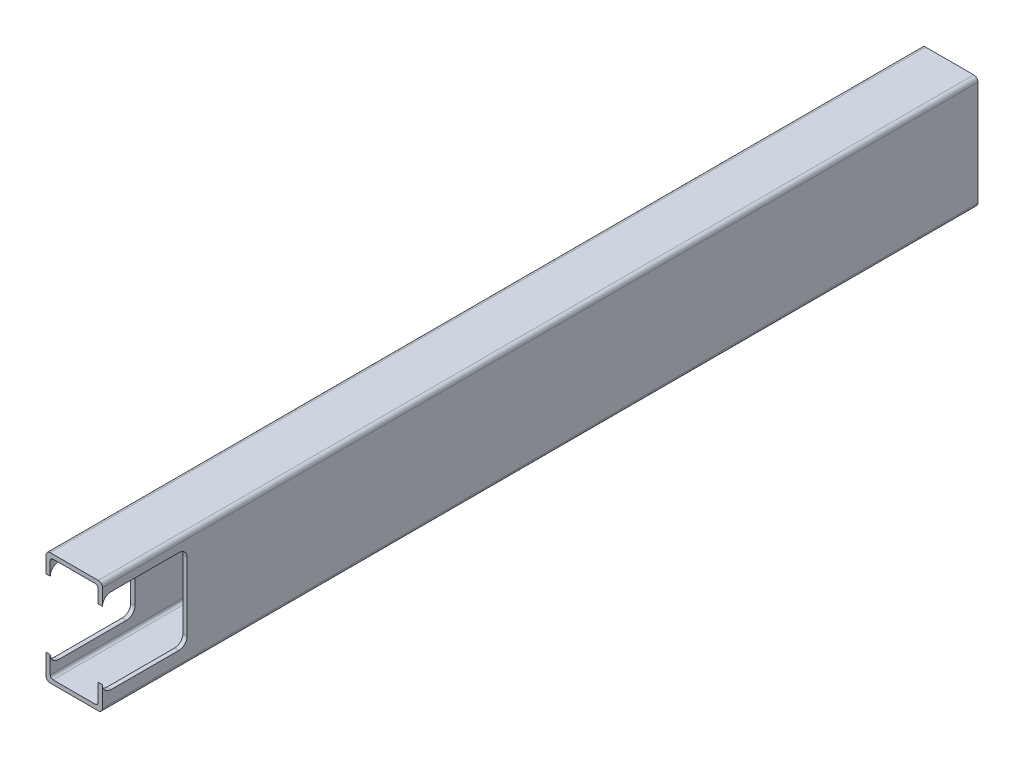
ISO-10303-21;
HEADER;
FILE_DESCRIPTION(('STEP AP214'),'2;1');
FILE_NAME('part.step','',(''),(''),'','','');
FILE_SCHEMA(('AUTOMOTIVE_DESIGN { 1 0 10303 214 1 1 1 1 }'));
ENDSEC;
DATA;
#1=APPLICATION_CONTEXT('core data for automotive mechanical design processes');
#2=APPLICATION_PROTOCOL_DEFINITION('international standard','automotive_design',2000,#1);
#3=PRODUCT_CONTEXT('',#1,'mechanical');
#4=PRODUCT('Part','Part','',(#3));
#5=PRODUCT_RELATED_PRODUCT_CATEGORY('part','',(#4));
#6=PRODUCT_DEFINITION_FORMATION('','',#4);
#7=PRODUCT_DEFINITION_CONTEXT('part definition',#1,'design');
#8=PRODUCT_DEFINITION('design','',#6,#7);
#9=PRODUCT_DEFINITION_SHAPE('','',#8);
#10=(LENGTH_UNIT() NAMED_UNIT(*) SI_UNIT(.MILLI.,.METRE.));
#11=(NAMED_UNIT(*) PLANE_ANGLE_UNIT() SI_UNIT($,.RADIAN.));
#12=(NAMED_UNIT(*) SI_UNIT($,.STERADIAN.) SOLID_ANGLE_UNIT());
#13=UNCERTAINTY_MEASURE_WITH_UNIT(LENGTH_MEASURE(1.E-05),#10,'distance_accuracy_value','');
#14=(GEOMETRIC_REPRESENTATION_CONTEXT(3) GLOBAL_UNCERTAINTY_ASSIGNED_CONTEXT((#13)) GLOBAL_UNIT_ASSIGNED_CONTEXT((#10,
#11,#12)) REPRESENTATION_CONTEXT('',''));
#15=CARTESIAN_POINT('',(0.,0.,0.));
#16=DIRECTION('',(0.,0.,1.));
#17=DIRECTION('',(1.,0.,0.));
#18=AXIS2_PLACEMENT_3D('',#15,#16,#17);
#19=CARTESIAN_POINT('',(-1.5,38.5,30.));
#20=DIRECTION('',(0.,0.,-1.));
#21=DIRECTION('',(-1.,0.,0.));
#22=AXIS2_PLACEMENT_3D('',#19,#20,#21);
#23=PLANE('',#22);
#24=DIRECTION('',(1.,0.,0.));
#25=VECTOR('',#24,1.);
#26=CARTESIAN_POINT('',(-69.4264068711928,32.7499999983111,30.));
#27=LINE('',#26,#25);
#28=CARTESIAN_POINT('',(0.,32.7499999983111,30.));
#29=VERTEX_POINT('',#28);
#30=CARTESIAN_POINT('',(-1.5,32.7499999983111,30.));
#31=VERTEX_POINT('',#30);
#32=EDGE_CURVE('E346',#29,#31,#27,.F.);
#33=ORIENTED_EDGE('',*,*,#32,.F.);
#34=DIRECTION('',(0.,1.,0.));
#35=VECTOR('',#34,1.);
#36=CARTESIAN_POINT('',(0.,38.5,30.));
#37=LINE('',#36,#35);
#38=CARTESIAN_POINT('',(0.,38.5,30.));
#39=VERTEX_POINT('',#38);
#40=EDGE_CURVE('E426',#29,#39,#37,.T.);
#41=ORIENTED_EDGE('',*,*,#40,.T.);
#42=CARTESIAN_POINT('',(-1.5,38.5,30.));
#43=DIRECTION('',(0.,0.,1.));
#44=DIRECTION('',(-1.,0.,0.));
#45=AXIS2_PLACEMENT_3D('',#42,#43,#44);
#46=CIRCLE('',#45,1.5);
#47=CARTESIAN_POINT('',(-1.50000000000002,40.,30.));
#48=VERTEX_POINT('',#47);
#49=EDGE_CURVE('E423',#39,#48,#46,.T.);
#50=ORIENTED_EDGE('',*,*,#49,.T.);
#51=DIRECTION('',(-1.,0.,0.));
#52=VECTOR('',#51,1.);
#53=CARTESIAN_POINT('',(-18.5,40.,30.));
#54=LINE('',#53,#52);
#55=CARTESIAN_POINT('',(-18.5,40.,30.));
#56=VERTEX_POINT('',#55);
#57=EDGE_CURVE('E420',#48,#56,#54,.T.);
#58=ORIENTED_EDGE('',*,*,#57,.T.);
#59=CARTESIAN_POINT('',(-18.5,38.5,30.));
#60=DIRECTION('',(0.,0.,1.));
#61=DIRECTION('',(-1.,0.,0.));
#62=AXIS2_PLACEMENT_3D('',#59,#60,#61);
#63=CIRCLE('',#62,1.50000000000001);
#64=CARTESIAN_POINT('',(-20.,38.5,30.));
#65=VERTEX_POINT('',#64);
#66=EDGE_CURVE('E417',#56,#65,#63,.T.);
#67=ORIENTED_EDGE('',*,*,#66,.T.);
#68=DIRECTION('',(0.,-1.,0.));
#69=VECTOR('',#68,1.);
#70=CARTESIAN_POINT('',(-20.,38.5,30.));
#71=LINE('',#70,#69);
#72=CARTESIAN_POINT('',(-20.,32.7499999983111,30.));
#73=VERTEX_POINT('',#72);
#74=EDGE_CURVE('E413',#65,#73,#71,.T.);
#75=ORIENTED_EDGE('',*,*,#74,.T.);
#76=CARTESIAN_POINT('',(-18.5,32.7499999983111,30.));
#77=VERTEX_POINT('',#76);
#78=EDGE_CURVE('E342',#77,#73,#27,.F.);
#79=ORIENTED_EDGE('',*,*,#78,.F.);
#80=DIRECTION('',(0.,-1.,0.));
#81=VECTOR('',#80,1.);
#82=CARTESIAN_POINT('',(-18.5,37.5,30.));
#83=LINE('',#82,#81);
#84=CARTESIAN_POINT('',(-18.5,37.5,30.));
#85=VERTEX_POINT('',#84);
#86=EDGE_CURVE('E435',#85,#77,#83,.T.);
#87=ORIENTED_EDGE('',*,*,#86,.F.);
#88=CARTESIAN_POINT('',(-17.5,37.5,30.));
#89=DIRECTION('',(0.,0.,1.));
#90=DIRECTION('',(-1.,0.,0.));
#91=AXIS2_PLACEMENT_3D('',#88,#89,#90);
#92=CIRCLE('',#91,1.);
#93=CARTESIAN_POINT('',(-17.5,38.5,30.));
#94=VERTEX_POINT('',#93);
#95=EDGE_CURVE('E438',#94,#85,#92,.T.);
#96=ORIENTED_EDGE('',*,*,#95,.F.);
#97=DIRECTION('',(-1.,0.,0.));
#98=VECTOR('',#97,1.);
#99=CARTESIAN_POINT('',(-17.5,38.5,30.));
#100=LINE('',#99,#98);
#101=CARTESIAN_POINT('',(-2.5,38.5,30.));
#102=VERTEX_POINT('',#101);
#103=EDGE_CURVE('E271',#102,#94,#100,.T.);
#104=ORIENTED_EDGE('',*,*,#103,.F.);
#105=CARTESIAN_POINT('',(-2.5,37.5,30.));
#106=DIRECTION('',(0.,0.,1.));
#107=DIRECTION('',(-1.,0.,0.));
#108=AXIS2_PLACEMENT_3D('',#105,#106,#107);
#109=CIRCLE('',#108,1.);
#110=CARTESIAN_POINT('',(-1.5,37.5,30.));
#111=VERTEX_POINT('',#110);
#112=EDGE_CURVE('E260',#111,#102,#109,.T.);
#113=ORIENTED_EDGE('',*,*,#112,.F.);
#114=DIRECTION('',(0.,1.,0.));
#115=VECTOR('',#114,1.);
#116=CARTESIAN_POINT('',(-1.5,37.5,30.));
#117=LINE('',#116,#115);
#118=EDGE_CURVE('E248',#31,#111,#117,.T.);
#119=ORIENTED_EDGE('',*,*,#118,.F.);
#120=EDGE_LOOP('',(#33,#41,#50,#58,#67,#75,#79,#87,#96,#104,#113,#119));
#121=FACE_BOUND('',#120,.T.);
#122=ADVANCED_FACE('F36',(#121),#23,.F.);
#123=CARTESIAN_POINT('',(-1.5,38.5,-394.721359549899));
#124=DIRECTION('',(0.,0.,1.));
#125=DIRECTION('',(1.,0.,0.));
#126=AXIS2_PLACEMENT_3D('',#123,#124,#125);
#127=CYLINDRICAL_SURFACE('',#126,1.5);
#128=DIRECTION('',(0.,0.,1.));
#129=VECTOR('',#128,1.);
#130=CARTESIAN_POINT('',(0.,38.5,-394.721359549899));
#131=LINE('',#130,#129);
#132=CARTESIAN_POINT('',(0.,38.5,-279.999999999903));
#133=VERTEX_POINT('',#132);
#134=EDGE_CURVE('E469',#133,#39,#131,.T.);
#135=ORIENTED_EDGE('',*,*,#134,.F.);
#136=CARTESIAN_POINT('',(-1.5,38.5,-279.999999999903));
#137=DIRECTION('',(0.,0.,-1.));
#138=DIRECTION('',(-1.,0.,0.));
#139=AXIS2_PLACEMENT_3D('',#136,#137,#138);
#140=CIRCLE('',#139,1.5);
#141=CARTESIAN_POINT('',(-1.50000000000002,40.,-279.999999999903));
#142=VERTEX_POINT('',#141);
#143=EDGE_CURVE('E416',#133,#142,#140,.F.);
#144=ORIENTED_EDGE('',*,*,#143,.T.);
#145=DIRECTION('',(0.,0.,1.));
#146=VECTOR('',#145,1.);
#147=CARTESIAN_POINT('',(-1.50000000000002,40.,-394.721359549899));
#148=LINE('',#147,#146);
#149=EDGE_CURVE('E336',#142,#48,#148,.T.);
#150=ORIENTED_EDGE('',*,*,#149,.T.);
#151=ORIENTED_EDGE('',*,*,#49,.F.);
#152=EDGE_LOOP('',(#135,#144,#150,#151));
#153=FACE_BOUND('',#152,.T.);
#154=ADVANCED_FACE('F516',(#153),#127,.T.);
#155=CARTESIAN_POINT('',(0.,38.5,-394.721359549899));
#156=DIRECTION('',(1.,0.,0.));
#157=DIRECTION('',(0.,1.,0.));
#158=AXIS2_PLACEMENT_3D('',#155,#156,#157);
#159=PLANE('',#158);
#160=ORIENTED_EDGE('',*,*,#40,.F.);
#161=CARTESIAN_POINT('',(0.,32.7499999983111,27.));
#162=DIRECTION('',(1.,0.,0.));
#163=DIRECTION('',(0.,1.,0.));
#164=AXIS2_PLACEMENT_3D('',#161,#162,#163);
#165=CIRCLE('',#164,3.);
#166=CARTESIAN_POINT('',(0.,35.7499999983111,27.));
#167=VERTEX_POINT('',#166);
#168=EDGE_CURVE('E309',#29,#167,#165,.F.);
#169=ORIENTED_EDGE('',*,*,#168,.T.);
#170=DIRECTION('',(0.,0.,-1.));
#171=VECTOR('',#170,1.);
#172=CARTESIAN_POINT('',(0.,35.7499999983111,-394.721359549899));
#173=LINE('',#172,#171);
#174=CARTESIAN_POINT('',(0.,35.7499999983111,3.00000000000003));
#175=VERTEX_POINT('',#174);
#176=EDGE_CURVE('E299',#167,#175,#173,.T.);
#177=ORIENTED_EDGE('',*,*,#176,.T.);
#178=CARTESIAN_POINT('',(0.,32.7499999983111,3.00000000000001));
#179=DIRECTION('',(1.,0.,0.));
#180=DIRECTION('',(0.,1.,0.));
#181=AXIS2_PLACEMENT_3D('',#178,#179,#180);
#182=CIRCLE('',#181,3.);
#183=CARTESIAN_POINT('',(0.,32.7499999983111,0.));
#184=VERTEX_POINT('',#183);
#185=EDGE_CURVE('E288',#175,#184,#182,.F.);
#186=ORIENTED_EDGE('',*,*,#185,.T.);
#187=DIRECTION('',(0.,-1.,0.));
#188=VECTOR('',#187,1.);
#189=CARTESIAN_POINT('',(0.,38.5,0.));
#190=LINE('',#189,#188);
#191=CARTESIAN_POINT('',(0.,8.74999999831115,0.));
#192=VERTEX_POINT('',#191);
#193=EDGE_CURVE('E53',#184,#192,#190,.T.);
#194=ORIENTED_EDGE('',*,*,#193,.T.);
#195=CARTESIAN_POINT('',(0.,8.74999999831115,3.00000000000001));
#196=DIRECTION('',(1.,0.,0.));
#197=DIRECTION('',(0.,1.,0.));
#198=AXIS2_PLACEMENT_3D('',#195,#196,#197);
#199=CIRCLE('',#198,3.);
#200=CARTESIAN_POINT('',(0.,5.74999999831114,3.00000000000001));
#201=VERTEX_POINT('',#200);
#202=EDGE_CURVE('E287',#192,#201,#199,.F.);
#203=ORIENTED_EDGE('',*,*,#202,.T.);
#204=DIRECTION('',(0.,0.,1.));
#205=VECTOR('',#204,1.);
#206=CARTESIAN_POINT('',(0.,5.74999999831111,-394.721359549899));
#207=LINE('',#206,#205);
#208=CARTESIAN_POINT('',(0.,5.74999999831115,27.));
#209=VERTEX_POINT('',#208);
#210=EDGE_CURVE('E318',#201,#209,#207,.T.);
#211=ORIENTED_EDGE('',*,*,#210,.T.);
#212=CARTESIAN_POINT('',(0.,8.74999999831114,27.));
#213=DIRECTION('',(1.,0.,0.));
#214=DIRECTION('',(0.,1.,0.));
#215=AXIS2_PLACEMENT_3D('',#212,#213,#214);
#216=CIRCLE('',#215,3.);
#217=CARTESIAN_POINT('',(0.,8.74999999831115,30.));
#218=VERTEX_POINT('',#217);
#219=EDGE_CURVE('E321',#209,#218,#216,.F.);
#220=ORIENTED_EDGE('',*,*,#219,.T.);
#221=CARTESIAN_POINT('',(0.,1.50000000000002,30.));
#222=VERTEX_POINT('',#221);
#223=EDGE_CURVE('E407',#222,#218,#37,.T.);
#224=ORIENTED_EDGE('',*,*,#223,.F.);
#225=DIRECTION('',(0.,0.,1.));
#226=VECTOR('',#225,1.);
#227=CARTESIAN_POINT('',(0.,1.50000000000002,-394.721359549899));
#228=LINE('',#227,#226);
#229=CARTESIAN_POINT('',(0.,1.50000000000002,-279.999999999903));
#230=VERTEX_POINT('',#229);
#231=EDGE_CURVE('E466',#230,#222,#228,.T.);
#232=ORIENTED_EDGE('',*,*,#231,.F.);
#233=DIRECTION('',(0.,1.,0.));
#234=VECTOR('',#233,1.);
#235=CARTESIAN_POINT('',(0.,38.5,-279.999999999903));
#236=LINE('',#235,#234);
#237=EDGE_CURVE('E349',#230,#133,#236,.T.);
#238=ORIENTED_EDGE('',*,*,#237,.T.);
#239=ORIENTED_EDGE('',*,*,#134,.T.);
#240=EDGE_LOOP('',(#160,#169,#177,#186,#194,#203,#211,#220,#224,#232,#238,#239));
#241=FACE_BOUND('',#240,.T.);
#242=ADVANCED_FACE('F38',(#241),#159,.T.);
#243=CARTESIAN_POINT('',(-1.49999999999999,1.50000000000002,-394.721359549899));
#244=DIRECTION('',(0.,0.,1.));
#245=DIRECTION('',(1.,0.,0.));
#246=AXIS2_PLACEMENT_3D('',#243,#244,#245);
#247=CYLINDRICAL_SURFACE('',#246,1.5);
#248=DIRECTION('',(0.,0.,1.));
#249=VECTOR('',#248,1.);
#250=CARTESIAN_POINT('',(-1.50000000000001,0.,-394.721359549899));
#251=LINE('',#250,#249);
#252=CARTESIAN_POINT('',(-1.50000000000001,0.,-279.999999999903));
#253=VERTEX_POINT('',#252);
#254=CARTESIAN_POINT('',(-1.50000000000001,0.,30.));
#255=VERTEX_POINT('',#254);
#256=EDGE_CURVE('E463',#253,#255,#251,.T.);
#257=ORIENTED_EDGE('',*,*,#256,.F.);
#258=CARTESIAN_POINT('',(-1.49999999999999,1.50000000000002,-279.999999999903));
#259=DIRECTION('',(0.,0.,-1.));
#260=DIRECTION('',(-1.,0.,0.));
#261=AXIS2_PLACEMENT_3D('',#258,#259,#260);
#262=CIRCLE('',#261,1.5);
#263=EDGE_CURVE('E468',#253,#230,#262,.F.);
#264=ORIENTED_EDGE('',*,*,#263,.T.);
#265=ORIENTED_EDGE('',*,*,#231,.T.);
#266=CARTESIAN_POINT('',(-1.49999999999999,1.50000000000002,30.));
#267=DIRECTION('',(0.,0.,1.));
#268=DIRECTION('',(-1.,0.,0.));
#269=AXIS2_PLACEMENT_3D('',#266,#267,#268);
#270=CIRCLE('',#269,1.5);
#271=EDGE_CURVE('E395',#255,#222,#270,.T.);
#272=ORIENTED_EDGE('',*,*,#271,.F.);
#273=EDGE_LOOP('',(#257,#264,#265,#272));
#274=FACE_BOUND('',#273,.T.);
#275=ADVANCED_FACE('F524',(#274),#247,.T.);
#276=CARTESIAN_POINT('',(-18.5,0.,-394.721359549899));
#277=DIRECTION('',(0.,-1.,0.));
#278=DIRECTION('',(0.,0.,-1.));
#279=AXIS2_PLACEMENT_3D('',#276,#277,#278);
#280=PLANE('',#279);
#281=DIRECTION('',(0.,0.,1.));
#282=VECTOR('',#281,1.);
#283=CARTESIAN_POINT('',(-18.5,0.,-394.721359549899));
#284=LINE('',#283,#282);
#285=CARTESIAN_POINT('',(-18.5,0.,-279.999999999903));
#286=VERTEX_POINT('',#285);
#287=CARTESIAN_POINT('',(-18.5,0.,30.));
#288=VERTEX_POINT('',#287);
#289=EDGE_CURVE('E314',#286,#288,#284,.T.);
#290=ORIENTED_EDGE('',*,*,#289,.F.);
#291=DIRECTION('',(1.,0.,0.));
#292=VECTOR('',#291,1.);
#293=CARTESIAN_POINT('',(-18.5,0.,-279.999999999903));
#294=LINE('',#293,#292);
#295=EDGE_CURVE('E465',#286,#253,#294,.T.);
#296=ORIENTED_EDGE('',*,*,#295,.T.);
#297=ORIENTED_EDGE('',*,*,#256,.T.);
#298=DIRECTION('',(1.,0.,0.));
#299=VECTOR('',#298,1.);
#300=CARTESIAN_POINT('',(-18.5,0.,30.));
#301=LINE('',#300,#299);
#302=EDGE_CURVE('E397',#288,#255,#301,.T.);
#303=ORIENTED_EDGE('',*,*,#302,.F.);
#304=EDGE_LOOP('',(#290,#296,#297,#303));
#305=FACE_BOUND('',#304,.T.);
#306=ADVANCED_FACE('F527',(#305),#280,.T.);
#307=CARTESIAN_POINT('',(-18.5,1.50000000000002,-394.721359549899));
#308=DIRECTION('',(0.,0.,1.));
#309=DIRECTION('',(1.,0.,0.));
#310=AXIS2_PLACEMENT_3D('',#307,#308,#309);
#311=CYLINDRICAL_SURFACE('',#310,1.5);
#312=DIRECTION('',(0.,0.,1.));
#313=VECTOR('',#312,1.);
#314=CARTESIAN_POINT('',(-20.,1.50000000000002,-394.721359549899));
#315=LINE('',#314,#313);
#316=CARTESIAN_POINT('',(-20.,1.50000000000002,-279.999999999903));
#317=VERTEX_POINT('',#316);
#318=CARTESIAN_POINT('',(-20.,1.50000000000002,30.));
#319=VERTEX_POINT('',#318);
#320=EDGE_CURVE('E351',#317,#319,#315,.T.);
#321=ORIENTED_EDGE('',*,*,#320,.F.);
#322=CARTESIAN_POINT('',(-18.5,1.50000000000002,-279.999999999903));
#323=DIRECTION('',(0.,0.,-1.));
#324=DIRECTION('',(-1.,0.,0.));
#325=AXIS2_PLACEMENT_3D('',#322,#323,#324);
#326=CIRCLE('',#325,1.5);
#327=EDGE_CURVE('E462',#317,#286,#326,.F.);
#328=ORIENTED_EDGE('',*,*,#327,.T.);
#329=ORIENTED_EDGE('',*,*,#289,.T.);
#330=CARTESIAN_POINT('',(-18.5,1.50000000000002,30.));
#331=DIRECTION('',(0.,0.,1.));
#332=DIRECTION('',(1.,0.,0.));
#333=AXIS2_PLACEMENT_3D('',#330,#331,#332);
#334=CIRCLE('',#333,1.5);
#335=EDGE_CURVE('E404',#319,#288,#334,.T.);
#336=ORIENTED_EDGE('',*,*,#335,.F.);
#337=EDGE_LOOP('',(#321,#328,#329,#336));
#338=FACE_BOUND('',#337,.T.);
#339=ADVANCED_FACE('F531',(#338),#311,.T.);
#340=CARTESIAN_POINT('',(-20.,38.5,-394.721359549899));
#341=DIRECTION('',(-1.,0.,0.));
#342=DIRECTION('',(0.,-1.,0.));
#343=AXIS2_PLACEMENT_3D('',#340,#341,#342);
#344=PLANE('',#343);
#345=DIRECTION('',(0.,0.,1.));
#346=VECTOR('',#345,1.);
#347=CARTESIAN_POINT('',(-20.,35.7499999983111,-394.721359549899));
#348=LINE('',#347,#346);
#349=CARTESIAN_POINT('',(-20.,35.7499999983111,3.00000000000003));
#350=VERTEX_POINT('',#349);
#351=CARTESIAN_POINT('',(-20.,35.7499999983111,27.));
#352=VERTEX_POINT('',#351);
#353=EDGE_CURVE('E310',#350,#352,#348,.T.);
#354=ORIENTED_EDGE('',*,*,#353,.T.);
#355=CARTESIAN_POINT('',(-20.,32.7499999983111,27.));
#356=DIRECTION('',(-1.,0.,0.));
#357=DIRECTION('',(0.,-1.,0.));
#358=AXIS2_PLACEMENT_3D('',#355,#356,#357);
#359=CIRCLE('',#358,3.);
#360=EDGE_CURVE('E313',#352,#73,#359,.F.);
#361=ORIENTED_EDGE('',*,*,#360,.T.);
#362=ORIENTED_EDGE('',*,*,#74,.F.);
#363=DIRECTION('',(0.,0.,1.));
#364=VECTOR('',#363,1.);
#365=CARTESIAN_POINT('',(-20.,38.5,-394.721359549899));
#366=LINE('',#365,#364);
#367=CARTESIAN_POINT('',(-20.,38.5,-279.999999999903));
#368=VERTEX_POINT('',#367);
#369=EDGE_CURVE('E457',#368,#65,#366,.T.);
#370=ORIENTED_EDGE('',*,*,#369,.F.);
#371=DIRECTION('',(0.,-1.,0.));
#372=VECTOR('',#371,1.);
#373=CARTESIAN_POINT('',(-20.,38.5,-279.999999999903));
#374=LINE('',#373,#372);
#375=EDGE_CURVE('E339',#368,#317,#374,.T.);
#376=ORIENTED_EDGE('',*,*,#375,.T.);
#377=ORIENTED_EDGE('',*,*,#320,.T.);
#378=CARTESIAN_POINT('',(-20.,8.74999999831114,30.));
#379=VERTEX_POINT('',#378);
#380=EDGE_CURVE('E412',#379,#319,#71,.T.);
#381=ORIENTED_EDGE('',*,*,#380,.F.);
#382=CARTESIAN_POINT('',(-20.,8.74999999831114,27.));
#383=DIRECTION('',(-1.,0.,0.));
#384=DIRECTION('',(0.,-1.,0.));
#385=AXIS2_PLACEMENT_3D('',#382,#383,#384);
#386=CIRCLE('',#385,3.);
#387=CARTESIAN_POINT('',(-20.,5.74999999831115,27.));
#388=VERTEX_POINT('',#387);
#389=EDGE_CURVE('E151',#379,#388,#386,.F.);
#390=ORIENTED_EDGE('',*,*,#389,.T.);
#391=DIRECTION('',(0.,0.,-1.));
#392=VECTOR('',#391,1.);
#393=CARTESIAN_POINT('',(-20.,5.74999999831112,-394.721359549899));
#394=LINE('',#393,#392);
#395=CARTESIAN_POINT('',(-20.,5.74999999831114,3.00000000000001));
#396=VERTEX_POINT('',#395);
#397=EDGE_CURVE('E322',#388,#396,#394,.T.);
#398=ORIENTED_EDGE('',*,*,#397,.T.);
#399=CARTESIAN_POINT('',(-20.,8.74999999831115,3.00000000000001));
#400=DIRECTION('',(-1.,0.,0.));
#401=DIRECTION('',(0.,-1.,0.));
#402=AXIS2_PLACEMENT_3D('',#399,#400,#401);
#403=CIRCLE('',#402,3.);
#404=CARTESIAN_POINT('',(-20.,8.74999999831115,0.));
#405=VERTEX_POINT('',#404);
#406=EDGE_CURVE('E293',#396,#405,#403,.F.);
#407=ORIENTED_EDGE('',*,*,#406,.T.);
#408=DIRECTION('',(0.,1.,0.));
#409=VECTOR('',#408,1.);
#410=CARTESIAN_POINT('',(-20.,38.5,0.));
#411=LINE('',#410,#409);
#412=CARTESIAN_POINT('',(-20.,32.7499999983111,0.));
#413=VERTEX_POINT('',#412);
#414=EDGE_CURVE('E289',#405,#413,#411,.T.);
#415=ORIENTED_EDGE('',*,*,#414,.T.);
#416=CARTESIAN_POINT('',(-20.,32.7499999983111,3.00000000000001));
#417=DIRECTION('',(-1.,0.,0.));
#418=DIRECTION('',(0.,-1.,0.));
#419=AXIS2_PLACEMENT_3D('',#416,#417,#418);
#420=CIRCLE('',#419,3.);
#421=EDGE_CURVE('E292',#413,#350,#420,.F.);
#422=ORIENTED_EDGE('',*,*,#421,.T.);
#423=EDGE_LOOP('',(#354,#361,#362,#370,#376,#377,#381,#390,#398,#407,#415,#422));
#424=FACE_BOUND('',#423,.T.);
#425=ADVANCED_FACE('F535',(#424),#344,.T.);
#426=CARTESIAN_POINT('',(-18.5,38.5,-394.721359549899));
#427=DIRECTION('',(0.,0.,1.));
#428=DIRECTION('',(1.,0.,0.));
#429=AXIS2_PLACEMENT_3D('',#426,#427,#428);
#430=CYLINDRICAL_SURFACE('',#429,1.50000000000001);
#431=DIRECTION('',(0.,0.,1.));
#432=VECTOR('',#431,1.);
#433=CARTESIAN_POINT('',(-18.5,40.,-394.721359549899));
#434=LINE('',#433,#432);
#435=CARTESIAN_POINT('',(-18.5,40.,-279.999999999903));
#436=VERTEX_POINT('',#435);
#437=EDGE_CURVE('E453',#436,#56,#434,.T.);
#438=ORIENTED_EDGE('',*,*,#437,.F.);
#439=CARTESIAN_POINT('',(-18.5,38.5,-279.999999999903));
#440=DIRECTION('',(0.,0.,-1.));
#441=DIRECTION('',(-1.,0.,0.));
#442=AXIS2_PLACEMENT_3D('',#439,#440,#441);
#443=CIRCLE('',#442,1.50000000000001);
#444=EDGE_CURVE('E302',#436,#368,#443,.F.);
#445=ORIENTED_EDGE('',*,*,#444,.T.);
#446=ORIENTED_EDGE('',*,*,#369,.T.);
#447=ORIENTED_EDGE('',*,*,#66,.F.);
#448=EDGE_LOOP('',(#438,#445,#446,#447));
#449=FACE_BOUND('',#448,.T.);
#450=ADVANCED_FACE('F538',(#449),#430,.T.);
#451=CARTESIAN_POINT('',(-18.5,40.,-394.721359549899));
#452=DIRECTION('',(0.,1.,0.));
#453=DIRECTION('',(-1.,0.,0.));
#454=AXIS2_PLACEMENT_3D('',#451,#452,#453);
#455=PLANE('',#454);
#456=ORIENTED_EDGE('',*,*,#149,.F.);
#457=DIRECTION('',(-1.,0.,0.));
#458=VECTOR('',#457,1.);
#459=CARTESIAN_POINT('',(-18.5,40.,-279.999999999903));
#460=LINE('',#459,#458);
#461=EDGE_CURVE('E456',#142,#436,#460,.T.);
#462=ORIENTED_EDGE('',*,*,#461,.T.);
#463=ORIENTED_EDGE('',*,*,#437,.T.);
#464=ORIENTED_EDGE('',*,*,#57,.F.);
#465=EDGE_LOOP('',(#456,#462,#463,#464));
#466=FACE_BOUND('',#465,.T.);
#467=ADVANCED_FACE('F508',(#466),#455,.T.);
#468=CARTESIAN_POINT('',(-2.49999999999999,2.50000000000002,-394.721359549899));
#469=DIRECTION('',(0.,0.,1.));
#470=DIRECTION('',(1.,0.,0.));
#471=AXIS2_PLACEMENT_3D('',#468,#469,#470);
#472=CYLINDRICAL_SURFACE('',#471,0.999999999999994);
#473=CARTESIAN_POINT('',(-2.49999999999999,2.50000000000002,-279.999999999903));
#474=DIRECTION('',(0.,0.,-1.));
#475=DIRECTION('',(-1.,0.,0.));
#476=AXIS2_PLACEMENT_3D('',#473,#474,#475);
#477=CIRCLE('',#476,0.999999999999994);
#478=CARTESIAN_POINT('',(-2.49999999999999,1.50000000000003,-279.999999999903));
#479=VERTEX_POINT('',#478);
#480=CARTESIAN_POINT('',(-1.49999999999999,2.50000000000002,-279.999999999903));
#481=VERTEX_POINT('',#480);
#482=EDGE_CURVE('E474',#479,#481,#477,.F.);
#483=ORIENTED_EDGE('',*,*,#482,.F.);
#484=DIRECTION('',(0.,0.,1.));
#485=VECTOR('',#484,1.);
#486=CARTESIAN_POINT('',(-2.49999999999999,1.50000000000003,-394.721359549899));
#487=LINE('',#486,#485);
#488=CARTESIAN_POINT('',(-2.49999999999999,1.50000000000003,30.));
#489=VERTEX_POINT('',#488);
#490=EDGE_CURVE('E285',#479,#489,#487,.T.);
#491=ORIENTED_EDGE('',*,*,#490,.T.);
#492=CARTESIAN_POINT('',(-2.49999999999999,2.50000000000002,30.));
#493=DIRECTION('',(0.,0.,1.));
#494=DIRECTION('',(-1.,0.,0.));
#495=AXIS2_PLACEMENT_3D('',#492,#493,#494);
#496=CIRCLE('',#495,0.999999999999994);
#497=CARTESIAN_POINT('',(-1.49999999999999,2.50000000000002,30.));
#498=VERTEX_POINT('',#497);
#499=EDGE_CURVE('E281',#489,#498,#496,.T.);
#500=ORIENTED_EDGE('',*,*,#499,.T.);
#501=DIRECTION('',(0.,0.,1.));
#502=VECTOR('',#501,1.);
#503=CARTESIAN_POINT('',(-1.49999999999999,2.50000000000002,-394.721359549899));
#504=LINE('',#503,#502);
#505=EDGE_CURVE('E259',#481,#498,#504,.T.);
#506=ORIENTED_EDGE('',*,*,#505,.F.);
#507=EDGE_LOOP('',(#483,#491,#500,#506));
#508=FACE_BOUND('',#507,.T.);
#509=ADVANCED_FACE('F551',(#508),#472,.F.);
#510=CARTESIAN_POINT('',(-17.5,1.50000000000002,-394.721359549899));
#511=DIRECTION('',(0.,-1.,0.));
#512=DIRECTION('',(1.,0.,0.));
#513=AXIS2_PLACEMENT_3D('',#510,#511,#512);
#514=PLANE('',#513);
#515=DIRECTION('',(1.,0.,0.));
#516=VECTOR('',#515,1.);
#517=CARTESIAN_POINT('',(-17.5,1.50000000000002,-279.999999999903));
#518=LINE('',#517,#516);
#519=CARTESIAN_POINT('',(-17.5,1.50000000000002,-279.999999999903));
#520=VERTEX_POINT('',#519);
#521=EDGE_CURVE('E280',#520,#479,#518,.T.);
#522=ORIENTED_EDGE('',*,*,#521,.F.);
#523=DIRECTION('',(0.,0.,1.));
#524=VECTOR('',#523,1.);
#525=CARTESIAN_POINT('',(-17.5,1.50000000000002,-394.721359549899));
#526=LINE('',#525,#524);
#527=CARTESIAN_POINT('',(-17.5,1.50000000000001,30.));
#528=VERTEX_POINT('',#527);
#529=EDGE_CURVE('E284',#520,#528,#526,.T.);
#530=ORIENTED_EDGE('',*,*,#529,.T.);
#531=DIRECTION('',(1.,0.,0.));
#532=VECTOR('',#531,1.);
#533=CARTESIAN_POINT('',(-17.5,1.50000000000002,30.));
#534=LINE('',#533,#532);
#535=EDGE_CURVE('E427',#528,#489,#534,.T.);
#536=ORIENTED_EDGE('',*,*,#535,.T.);
#537=ORIENTED_EDGE('',*,*,#490,.F.);
#538=EDGE_LOOP('',(#522,#530,#536,#537));
#539=FACE_BOUND('',#538,.T.);
#540=ADVANCED_FACE('F588',(#539),#514,.F.);
#541=CARTESIAN_POINT('',(-17.5,2.50000000000002,-394.721359549899));
#542=DIRECTION('',(0.,0.,1.));
#543=DIRECTION('',(1.,0.,0.));
#544=AXIS2_PLACEMENT_3D('',#541,#542,#543);
#545=CYLINDRICAL_SURFACE('',#544,0.999999999999997);
#546=CARTESIAN_POINT('',(-17.5,2.50000000000002,-279.999999999903));
#547=DIRECTION('',(0.,0.,-1.));
#548=DIRECTION('',(-1.,0.,0.));
#549=AXIS2_PLACEMENT_3D('',#546,#547,#548);
#550=CIRCLE('',#549,0.999999999999997);
#551=CARTESIAN_POINT('',(-18.5,2.50000000000002,-279.999999999903));
#552=VERTEX_POINT('',#551);
#553=EDGE_CURVE('E499',#552,#520,#550,.F.);
#554=ORIENTED_EDGE('',*,*,#553,.F.);
#555=DIRECTION('',(0.,0.,1.));
#556=VECTOR('',#555,1.);
#557=CARTESIAN_POINT('',(-18.5,2.50000000000002,-394.721359549899));
#558=LINE('',#557,#556);
#559=CARTESIAN_POINT('',(-18.5,2.50000000000002,30.));
#560=VERTEX_POINT('',#559);
#561=EDGE_CURVE('E430',#552,#560,#558,.T.);
#562=ORIENTED_EDGE('',*,*,#561,.T.);
#563=CARTESIAN_POINT('',(-17.5,2.50000000000002,30.));
#564=DIRECTION('',(0.,0.,1.));
#565=DIRECTION('',(1.,0.,0.));
#566=AXIS2_PLACEMENT_3D('',#563,#564,#565);
#567=CIRCLE('',#566,0.999999999999997);
#568=EDGE_CURVE('E431',#560,#528,#567,.T.);
#569=ORIENTED_EDGE('',*,*,#568,.T.);
#570=ORIENTED_EDGE('',*,*,#529,.F.);
#571=EDGE_LOOP('',(#554,#562,#569,#570));
#572=FACE_BOUND('',#571,.T.);
#573=ADVANCED_FACE('F593',(#572),#545,.F.);
#574=CARTESIAN_POINT('',(-18.5,37.5,-394.721359549899));
#575=DIRECTION('',(-1.,0.,0.));
#576=DIRECTION('',(0.,-1.,0.));
#577=AXIS2_PLACEMENT_3D('',#574,#575,#576);
#578=PLANE('',#577);
#579=CARTESIAN_POINT('',(-18.5,32.7499999983111,27.));
#580=DIRECTION('',(-1.,0.,0.));
#581=DIRECTION('',(0.,-1.,0.));
#582=AXIS2_PLACEMENT_3D('',#579,#580,#581);
#583=CIRCLE('',#582,3.);
#584=CARTESIAN_POINT('',(-18.5,35.7499999983111,27.));
#585=VERTEX_POINT('',#584);
#586=EDGE_CURVE('E340',#585,#77,#583,.F.);
#587=ORIENTED_EDGE('',*,*,#586,.F.);
#588=DIRECTION('',(0.,0.,1.));
#589=VECTOR('',#588,1.);
#590=CARTESIAN_POINT('',(-18.5,35.7499999983111,-394.721359549899));
#591=LINE('',#590,#589);
#592=CARTESIAN_POINT('',(-18.5,35.7499999983111,3.00000000000003));
#593=VERTEX_POINT('',#592);
#594=EDGE_CURVE('E315',#593,#585,#591,.T.);
#595=ORIENTED_EDGE('',*,*,#594,.F.);
#596=CARTESIAN_POINT('',(-18.5,32.7499999983111,3.00000000000001));
#597=DIRECTION('',(-1.,0.,0.));
#598=DIRECTION('',(0.,-1.,0.));
#599=AXIS2_PLACEMENT_3D('',#596,#597,#598);
#600=CIRCLE('',#599,3.);
#601=CARTESIAN_POINT('',(-18.5,32.7499999983111,0.));
#602=VERTEX_POINT('',#601);
#603=EDGE_CURVE('E303',#602,#593,#600,.F.);
#604=ORIENTED_EDGE('',*,*,#603,.F.);
#605=DIRECTION('',(0.,1.,0.));
#606=VECTOR('',#605,1.);
#607=CARTESIAN_POINT('',(-18.5,37.5,0.));
#608=LINE('',#607,#606);
#609=CARTESIAN_POINT('',(-18.5,8.74999999831115,0.));
#610=VERTEX_POINT('',#609);
#611=EDGE_CURVE('E294',#610,#602,#608,.T.);
#612=ORIENTED_EDGE('',*,*,#611,.F.);
#613=CARTESIAN_POINT('',(-18.5,8.74999999831115,3.00000000000001));
#614=DIRECTION('',(-1.,0.,0.));
#615=DIRECTION('',(0.,-1.,0.));
#616=AXIS2_PLACEMENT_3D('',#613,#614,#615);
#617=CIRCLE('',#616,3.);
#618=CARTESIAN_POINT('',(-18.5,5.74999999831114,3.00000000000001));
#619=VERTEX_POINT('',#618);
#620=EDGE_CURVE('E332',#619,#610,#617,.F.);
#621=ORIENTED_EDGE('',*,*,#620,.F.);
#622=DIRECTION('',(0.,0.,-1.));
#623=VECTOR('',#622,1.);
#624=CARTESIAN_POINT('',(-18.5,5.74999999831112,-394.721359549899));
#625=LINE('',#624,#623);
#626=CARTESIAN_POINT('',(-18.5,5.74999999831115,27.));
#627=VERTEX_POINT('',#626);
#628=EDGE_CURVE('E325',#627,#619,#625,.T.);
#629=ORIENTED_EDGE('',*,*,#628,.F.);
#630=CARTESIAN_POINT('',(-18.5,8.74999999831114,27.));
#631=DIRECTION('',(-1.,0.,0.));
#632=DIRECTION('',(0.,-1.,0.));
#633=AXIS2_PLACEMENT_3D('',#630,#631,#632);
#634=CIRCLE('',#633,3.);
#635=CARTESIAN_POINT('',(-18.5,8.74999999831115,30.));
#636=VERTEX_POINT('',#635);
#637=EDGE_CURVE('E146',#636,#627,#634,.F.);
#638=ORIENTED_EDGE('',*,*,#637,.F.);
#639=EDGE_CURVE('E434',#636,#560,#83,.T.);
#640=ORIENTED_EDGE('',*,*,#639,.T.);
#641=ORIENTED_EDGE('',*,*,#561,.F.);
#642=DIRECTION('',(0.,-1.,0.));
#643=VECTOR('',#642,1.);
#644=CARTESIAN_POINT('',(-18.5,37.5,-279.999999999903));
#645=LINE('',#644,#643);
#646=CARTESIAN_POINT('',(-18.5,37.5,-279.999999999903));
#647=VERTEX_POINT('',#646);
#648=EDGE_CURVE('E496',#647,#552,#645,.T.);
#649=ORIENTED_EDGE('',*,*,#648,.F.);
#650=DIRECTION('',(0.,0.,1.));
#651=VECTOR('',#650,1.);
#652=CARTESIAN_POINT('',(-18.5,37.5,-394.721359549899));
#653=LINE('',#652,#651);
#654=EDGE_CURVE('E437',#647,#85,#653,.T.);
#655=ORIENTED_EDGE('',*,*,#654,.T.);
#656=ORIENTED_EDGE('',*,*,#86,.T.);
#657=EDGE_LOOP('',(#587,#595,#604,#612,#621,#629,#638,#640,#641,#649,#655,#656));
#658=FACE_BOUND('',#657,.T.);
#659=ADVANCED_FACE('F385',(#658),#578,.F.);
#660=CARTESIAN_POINT('',(-17.5,37.5,-394.721359549899));
#661=DIRECTION('',(0.,0.,1.));
#662=DIRECTION('',(1.,0.,0.));
#663=AXIS2_PLACEMENT_3D('',#660,#661,#662);
#664=CYLINDRICAL_SURFACE('',#663,1.);
#665=CARTESIAN_POINT('',(-17.5,37.5,-279.999999999903));
#666=DIRECTION('',(0.,0.,-1.));
#667=DIRECTION('',(-1.,0.,0.));
#668=AXIS2_PLACEMENT_3D('',#665,#666,#667);
#669=CIRCLE('',#668,1.);
#670=CARTESIAN_POINT('',(-17.5,38.5,-279.999999999903));
#671=VERTEX_POINT('',#670);
#672=EDGE_CURVE('E493',#671,#647,#669,.F.);
#673=ORIENTED_EDGE('',*,*,#672,.F.);
#674=DIRECTION('',(0.,0.,1.));
#675=VECTOR('',#674,1.);
#676=CARTESIAN_POINT('',(-17.5,38.5,-394.721359549899));
#677=LINE('',#676,#675);
#678=EDGE_CURVE('E436',#671,#94,#677,.T.);
#679=ORIENTED_EDGE('',*,*,#678,.T.);
#680=ORIENTED_EDGE('',*,*,#95,.T.);
#681=ORIENTED_EDGE('',*,*,#654,.F.);
#682=EDGE_LOOP('',(#673,#679,#680,#681));
#683=FACE_BOUND('',#682,.T.);
#684=ADVANCED_FACE('F600',(#683),#664,.F.);
#685=CARTESIAN_POINT('',(-17.5,38.5,-394.721359549899));
#686=DIRECTION('',(0.,1.,0.));
#687=DIRECTION('',(-1.,0.,0.));
#688=AXIS2_PLACEMENT_3D('',#685,#686,#687);
#689=PLANE('',#688);
#690=DIRECTION('',(-1.,0.,0.));
#691=VECTOR('',#690,1.);
#692=CARTESIAN_POINT('',(-17.5,38.5,-279.999999999903));
#693=LINE('',#692,#691);
#694=CARTESIAN_POINT('',(-2.5,38.5,-279.999999999903));
#695=VERTEX_POINT('',#694);
#696=EDGE_CURVE('E490',#695,#671,#693,.T.);
#697=ORIENTED_EDGE('',*,*,#696,.F.);
#698=DIRECTION('',(0.,0.,1.));
#699=VECTOR('',#698,1.);
#700=CARTESIAN_POINT('',(-2.5,38.5,-394.721359549899));
#701=LINE('',#700,#699);
#702=EDGE_CURVE('E440',#695,#102,#701,.T.);
#703=ORIENTED_EDGE('',*,*,#702,.T.);
#704=ORIENTED_EDGE('',*,*,#103,.T.);
#705=ORIENTED_EDGE('',*,*,#678,.F.);
#706=EDGE_LOOP('',(#697,#703,#704,#705));
#707=FACE_BOUND('',#706,.T.);
#708=ADVANCED_FACE('F602',(#707),#689,.F.);
#709=CARTESIAN_POINT('',(-2.5,37.5,-394.721359549899));
#710=DIRECTION('',(0.,0.,1.));
#711=DIRECTION('',(1.,0.,0.));
#712=AXIS2_PLACEMENT_3D('',#709,#710,#711);
#713=CYLINDRICAL_SURFACE('',#712,1.);
#714=CARTESIAN_POINT('',(-2.5,37.5,-279.999999999903));
#715=DIRECTION('',(0.,0.,-1.));
#716=DIRECTION('',(-1.,0.,0.));
#717=AXIS2_PLACEMENT_3D('',#714,#715,#716);
#718=CIRCLE('',#717,1.);
#719=CARTESIAN_POINT('',(-1.5,37.5,-279.999999999903));
#720=VERTEX_POINT('',#719);
#721=EDGE_CURVE('E269',#720,#695,#718,.F.);
#722=ORIENTED_EDGE('',*,*,#721,.F.);
#723=DIRECTION('',(0.,0.,1.));
#724=VECTOR('',#723,1.);
#725=CARTESIAN_POINT('',(-1.5,37.5,-394.721359549899));
#726=LINE('',#725,#724);
#727=EDGE_CURVE('E252',#720,#111,#726,.T.);
#728=ORIENTED_EDGE('',*,*,#727,.T.);
#729=ORIENTED_EDGE('',*,*,#112,.T.);
#730=ORIENTED_EDGE('',*,*,#702,.F.);
#731=EDGE_LOOP('',(#722,#728,#729,#730));
#732=FACE_BOUND('',#731,.T.);
#733=ADVANCED_FACE('F265',(#732),#713,.F.);
#734=CARTESIAN_POINT('',(-1.5,37.5,-394.721359549899));
#735=DIRECTION('',(1.,0.,0.));
#736=DIRECTION('',(0.,1.,0.));
#737=AXIS2_PLACEMENT_3D('',#734,#735,#736);
#738=PLANE('',#737);
#739=CARTESIAN_POINT('',(-1.5,32.7499999983111,27.));
#740=DIRECTION('',(1.,0.,0.));
#741=DIRECTION('',(0.,1.,0.));
#742=AXIS2_PLACEMENT_3D('',#739,#740,#741);
#743=CIRCLE('',#742,3.);
#744=CARTESIAN_POINT('',(-1.5,35.7499999983111,27.));
#745=VERTEX_POINT('',#744);
#746=EDGE_CURVE('E255',#31,#745,#743,.F.);
#747=ORIENTED_EDGE('',*,*,#746,.F.);
#748=ORIENTED_EDGE('',*,*,#118,.T.);
#749=ORIENTED_EDGE('',*,*,#727,.F.);
#750=DIRECTION('',(0.,1.,0.));
#751=VECTOR('',#750,1.);
#752=CARTESIAN_POINT('',(-1.5,37.5,-279.999999999903));
#753=LINE('',#752,#751);
#754=EDGE_CURVE('E472',#481,#720,#753,.T.);
#755=ORIENTED_EDGE('',*,*,#754,.F.);
#756=ORIENTED_EDGE('',*,*,#505,.T.);
#757=CARTESIAN_POINT('',(-1.49999999999999,8.74999999831114,30.));
#758=VERTEX_POINT('',#757);
#759=EDGE_CURVE('E262',#498,#758,#117,.T.);
#760=ORIENTED_EDGE('',*,*,#759,.T.);
#761=CARTESIAN_POINT('',(-1.49999999999999,8.74999999831114,27.));
#762=DIRECTION('',(1.,0.,0.));
#763=DIRECTION('',(0.,1.,0.));
#764=AXIS2_PLACEMENT_3D('',#761,#762,#763);
#765=CIRCLE('',#764,3.);
#766=CARTESIAN_POINT('',(-1.49999999999999,5.74999999831115,27.));
#767=VERTEX_POINT('',#766);
#768=EDGE_CURVE('E296',#767,#758,#765,.F.);
#769=ORIENTED_EDGE('',*,*,#768,.F.);
#770=DIRECTION('',(0.,0.,1.));
#771=VECTOR('',#770,1.);
#772=CARTESIAN_POINT('',(-1.49999999999999,5.74999999831111,-394.721359549899));
#773=LINE('',#772,#771);
#774=CARTESIAN_POINT('',(-1.49999999999999,5.74999999831114,3.00000000000001));
#775=VERTEX_POINT('',#774);
#776=EDGE_CURVE('E359',#775,#767,#773,.T.);
#777=ORIENTED_EDGE('',*,*,#776,.F.);
#778=CARTESIAN_POINT('',(-1.49999999999999,8.74999999831115,3.00000000000001));
#779=DIRECTION('',(1.,0.,0.));
#780=DIRECTION('',(0.,1.,0.));
#781=AXIS2_PLACEMENT_3D('',#778,#779,#780);
#782=CIRCLE('',#781,3.);
#783=CARTESIAN_POINT('',(-1.49999999999999,8.74999999831115,0.));
#784=VERTEX_POINT('',#783);
#785=EDGE_CURVE('E355',#784,#775,#782,.F.);
#786=ORIENTED_EDGE('',*,*,#785,.F.);
#787=DIRECTION('',(0.,-1.,0.));
#788=VECTOR('',#787,1.);
#789=CARTESIAN_POINT('',(-1.5,37.5,0.));
#790=LINE('',#789,#788);
#791=CARTESIAN_POINT('',(-1.5,32.7499999983111,0.));
#792=VERTEX_POINT('',#791);
#793=EDGE_CURVE('E45',#792,#784,#790,.T.);
#794=ORIENTED_EDGE('',*,*,#793,.F.);
#795=CARTESIAN_POINT('',(-1.5,32.7499999983111,3.00000000000001));
#796=DIRECTION('',(1.,0.,0.));
#797=DIRECTION('',(0.,1.,0.));
#798=AXIS2_PLACEMENT_3D('',#795,#796,#797);
#799=CIRCLE('',#798,3.);
#800=CARTESIAN_POINT('',(-1.5,35.7499999983111,3.00000000000003));
#801=VERTEX_POINT('',#800);
#802=EDGE_CURVE('E368',#801,#792,#799,.F.);
#803=ORIENTED_EDGE('',*,*,#802,.F.);
#804=DIRECTION('',(0.,0.,-1.));
#805=VECTOR('',#804,1.);
#806=CARTESIAN_POINT('',(-1.5,35.7499999983111,-394.721359549899));
#807=LINE('',#806,#805);
#808=EDGE_CURVE('E365',#745,#801,#807,.T.);
#809=ORIENTED_EDGE('',*,*,#808,.F.);
#810=EDGE_LOOP('',(#747,#748,#749,#755,#756,#760,#769,#777,#786,#794,#803,#809));
#811=FACE_BOUND('',#810,.T.);
#812=ADVANCED_FACE('F250',(#811),#738,.F.);
#813=CARTESIAN_POINT('',(-12.,41.4999999998545,-279.999999999903));
#814=DIRECTION('',(0.,0.,-1.));
#815=DIRECTION('',(-1.,0.,0.));
#816=AXIS2_PLACEMENT_3D('',#813,#814,#815);
#817=PLANE('',#816);
#818=ORIENTED_EDGE('',*,*,#143,.F.);
#819=ORIENTED_EDGE('',*,*,#237,.F.);
#820=ORIENTED_EDGE('',*,*,#263,.F.);
#821=ORIENTED_EDGE('',*,*,#295,.F.);
#822=ORIENTED_EDGE('',*,*,#327,.F.);
#823=ORIENTED_EDGE('',*,*,#375,.F.);
#824=ORIENTED_EDGE('',*,*,#444,.F.);
#825=ORIENTED_EDGE('',*,*,#461,.F.);
#826=EDGE_LOOP('',(#818,#819,#820,#821,#822,#823,#824,#825));
#827=FACE_BOUND('',#826,.T.);
#828=ORIENTED_EDGE('',*,*,#521,.T.);
#829=ORIENTED_EDGE('',*,*,#482,.T.);
#830=ORIENTED_EDGE('',*,*,#754,.T.);
#831=ORIENTED_EDGE('',*,*,#721,.T.);
#832=ORIENTED_EDGE('',*,*,#696,.T.);
#833=ORIENTED_EDGE('',*,*,#672,.T.);
#834=ORIENTED_EDGE('',*,*,#648,.T.);
#835=ORIENTED_EDGE('',*,*,#553,.T.);
#836=EDGE_LOOP('',(#828,#829,#830,#831,#832,#833,#834,#835));
#837=FACE_BOUND('',#836,.T.);
#838=ADVANCED_FACE('F512',(#827,#837),#817,.T.);
#839=ORIENTED_EDGE('',*,*,#223,.T.);
#840=DIRECTION('',(1.,0.,0.));
#841=VECTOR('',#840,1.);
#842=CARTESIAN_POINT('',(-69.4264068711928,8.74999999831114,30.));
#843=LINE('',#842,#841);
#844=EDGE_CURVE('E539',#218,#758,#843,.F.);
#845=ORIENTED_EDGE('',*,*,#844,.T.);
#846=ORIENTED_EDGE('',*,*,#759,.F.);
#847=ORIENTED_EDGE('',*,*,#499,.F.);
#848=ORIENTED_EDGE('',*,*,#535,.F.);
#849=ORIENTED_EDGE('',*,*,#568,.F.);
#850=ORIENTED_EDGE('',*,*,#639,.F.);
#851=EDGE_CURVE('E541',#636,#379,#843,.F.);
#852=ORIENTED_EDGE('',*,*,#851,.T.);
#853=ORIENTED_EDGE('',*,*,#380,.T.);
#854=ORIENTED_EDGE('',*,*,#335,.T.);
#855=ORIENTED_EDGE('',*,*,#302,.T.);
#856=ORIENTED_EDGE('',*,*,#271,.T.);
#857=EDGE_LOOP('',(#839,#845,#846,#847,#848,#849,#850,#852,#853,#854,#855,#856));
#858=FACE_BOUND('',#857,.T.);
#859=ADVANCED_FACE('F554',(#858),#23,.F.);
#860=CARTESIAN_POINT('',(-69.4264068711928,32.7499999983111,27.));
#861=DIRECTION('',(1.,0.,0.));
#862=DIRECTION('',(0.,0.,-1.));
#863=AXIS2_PLACEMENT_3D('',#860,#861,#862);
#864=CYLINDRICAL_SURFACE('',#863,3.);
#865=DIRECTION('',(1.,0.,0.));
#866=VECTOR('',#865,1.);
#867=CARTESIAN_POINT('',(-69.4264068711928,35.7499999983111,27.));
#868=LINE('',#867,#866);
#869=EDGE_CURVE('E343',#352,#585,#868,.T.);
#870=ORIENTED_EDGE('',*,*,#869,.T.);
#871=ORIENTED_EDGE('',*,*,#586,.T.);
#872=ORIENTED_EDGE('',*,*,#78,.T.);
#873=ORIENTED_EDGE('',*,*,#360,.F.);
#874=EDGE_LOOP('',(#870,#871,#872,#873));
#875=FACE_BOUND('',#874,.T.);
#876=ADVANCED_FACE('F393',(#875),#864,.F.);
#877=CARTESIAN_POINT('',(-69.4264068711928,35.7499999983111,3.00000000000003));
#878=DIRECTION('',(0.,-1.,0.));
#879=DIRECTION('',(1.,0.,0.));
#880=AXIS2_PLACEMENT_3D('',#877,#878,#879);
#881=PLANE('',#880);
#882=DIRECTION('',(1.,0.,0.));
#883=VECTOR('',#882,1.);
#884=CARTESIAN_POINT('',(-69.4264068711928,35.7499999983111,3.00000000000003));
#885=LINE('',#884,#883);
#886=EDGE_CURVE('E317',#350,#593,#885,.T.);
#887=ORIENTED_EDGE('',*,*,#886,.T.);
#888=ORIENTED_EDGE('',*,*,#594,.T.);
#889=ORIENTED_EDGE('',*,*,#869,.F.);
#890=ORIENTED_EDGE('',*,*,#353,.F.);
#891=EDGE_LOOP('',(#887,#888,#889,#890));
#892=FACE_BOUND('',#891,.T.);
#893=ADVANCED_FACE('F391',(#892),#881,.T.);
#894=CARTESIAN_POINT('',(-69.4264068711928,32.7499999983111,3.00000000000001));
#895=DIRECTION('',(1.,0.,0.));
#896=DIRECTION('',(0.,0.,-1.));
#897=AXIS2_PLACEMENT_3D('',#894,#895,#896);
#898=CYLINDRICAL_SURFACE('',#897,3.);
#899=DIRECTION('',(1.,0.,0.));
#900=VECTOR('',#899,1.);
#901=CARTESIAN_POINT('',(-69.4264068711928,32.7499999983111,0.));
#902=LINE('',#901,#900);
#903=EDGE_CURVE('E306',#413,#602,#902,.T.);
#904=ORIENTED_EDGE('',*,*,#903,.T.);
#905=ORIENTED_EDGE('',*,*,#603,.T.);
#906=ORIENTED_EDGE('',*,*,#886,.F.);
#907=ORIENTED_EDGE('',*,*,#421,.F.);
#908=EDGE_LOOP('',(#904,#905,#906,#907));
#909=FACE_BOUND('',#908,.T.);
#910=ADVANCED_FACE('F377',(#909),#898,.F.);
#911=CARTESIAN_POINT('',(-69.4264068711928,8.74999999831115,3.00000000000001));
#912=DIRECTION('',(1.,0.,0.));
#913=DIRECTION('',(0.,0.,-1.));
#914=AXIS2_PLACEMENT_3D('',#911,#912,#913);
#915=CYLINDRICAL_SURFACE('',#914,3.);
#916=DIRECTION('',(1.,0.,0.));
#917=VECTOR('',#916,1.);
#918=CARTESIAN_POINT('',(-69.4264068711928,5.74999999831114,3.00000000000001));
#919=LINE('',#918,#917);
#920=EDGE_CURVE('E305',#396,#619,#919,.T.);
#921=ORIENTED_EDGE('',*,*,#920,.T.);
#922=ORIENTED_EDGE('',*,*,#620,.T.);
#923=DIRECTION('',(1.,0.,0.));
#924=VECTOR('',#923,1.);
#925=CARTESIAN_POINT('',(-69.4264068711928,8.74999999831115,0.));
#926=LINE('',#925,#924);
#927=EDGE_CURVE('E46',#405,#610,#926,.T.);
#928=ORIENTED_EDGE('',*,*,#927,.F.);
#929=ORIENTED_EDGE('',*,*,#406,.F.);
#930=EDGE_LOOP('',(#921,#922,#928,#929));
#931=FACE_BOUND('',#930,.T.);
#932=ADVANCED_FACE('F642',(#931),#915,.F.);
#933=CARTESIAN_POINT('',(-69.4264068711928,8.74999999831114,27.));
#934=DIRECTION('',(1.,0.,0.));
#935=DIRECTION('',(0.,0.,-1.));
#936=AXIS2_PLACEMENT_3D('',#933,#934,#935);
#937=CYLINDRICAL_SURFACE('',#936,3.);
#938=ORIENTED_EDGE('',*,*,#851,.F.);
#939=ORIENTED_EDGE('',*,*,#637,.T.);
#940=DIRECTION('',(1.,0.,0.));
#941=VECTOR('',#940,1.);
#942=CARTESIAN_POINT('',(-69.4264068711928,5.74999999831115,27.));
#943=LINE('',#942,#941);
#944=EDGE_CURVE('E327',#388,#627,#943,.T.);
#945=ORIENTED_EDGE('',*,*,#944,.F.);
#946=ORIENTED_EDGE('',*,*,#389,.F.);
#947=EDGE_LOOP('',(#938,#939,#945,#946));
#948=FACE_BOUND('',#947,.T.);
#949=ADVANCED_FACE('F637',(#948),#937,.F.);
#950=CARTESIAN_POINT('',(-69.4264068711928,5.74999999831114,3.00000000000001));
#951=DIRECTION('',(0.,1.,0.));
#952=DIRECTION('',(0.,0.,-1.));
#953=AXIS2_PLACEMENT_3D('',#950,#951,#952);
#954=PLANE('',#953);
#955=ORIENTED_EDGE('',*,*,#944,.T.);
#956=ORIENTED_EDGE('',*,*,#628,.T.);
#957=ORIENTED_EDGE('',*,*,#920,.F.);
#958=ORIENTED_EDGE('',*,*,#397,.F.);
#959=EDGE_LOOP('',(#955,#956,#957,#958));
#960=FACE_BOUND('',#959,.T.);
#961=ADVANCED_FACE('F643',(#960),#954,.T.);
#962=CARTESIAN_POINT('',(-69.4264068711928,32.7499999983111,0.));
#963=DIRECTION('',(0.,0.,1.));
#964=DIRECTION('',(1.,0.,0.));
#965=AXIS2_PLACEMENT_3D('',#962,#963,#964);
#966=PLANE('',#965);
#967=ORIENTED_EDGE('',*,*,#927,.T.);
#968=ORIENTED_EDGE('',*,*,#611,.T.);
#969=ORIENTED_EDGE('',*,*,#903,.F.);
#970=ORIENTED_EDGE('',*,*,#414,.F.);
#971=EDGE_LOOP('',(#967,#968,#969,#970));
#972=FACE_BOUND('',#971,.T.);
#973=ADVANCED_FACE('F635',(#972),#966,.T.);
#974=EDGE_CURVE('E360',#767,#209,#943,.T.);
#975=ORIENTED_EDGE('',*,*,#974,.F.);
#976=ORIENTED_EDGE('',*,*,#768,.T.);
#977=ORIENTED_EDGE('',*,*,#844,.F.);
#978=ORIENTED_EDGE('',*,*,#219,.F.);
#979=EDGE_LOOP('',(#975,#976,#977,#978));
#980=FACE_BOUND('',#979,.T.);
#981=ADVANCED_FACE('F631',(#980),#937,.F.);
#982=EDGE_CURVE('E12',#784,#192,#926,.T.);
#983=ORIENTED_EDGE('',*,*,#982,.F.);
#984=ORIENTED_EDGE('',*,*,#785,.T.);
#985=EDGE_CURVE('E356',#775,#201,#919,.T.);
#986=ORIENTED_EDGE('',*,*,#985,.T.);
#987=ORIENTED_EDGE('',*,*,#202,.F.);
#988=EDGE_LOOP('',(#983,#984,#986,#987));
#989=FACE_BOUND('',#988,.T.);
#990=ADVANCED_FACE('F625',(#989),#915,.F.);
#991=ORIENTED_EDGE('',*,*,#985,.F.);
#992=ORIENTED_EDGE('',*,*,#776,.T.);
#993=ORIENTED_EDGE('',*,*,#974,.T.);
#994=ORIENTED_EDGE('',*,*,#210,.F.);
#995=EDGE_LOOP('',(#991,#992,#993,#994));
#996=FACE_BOUND('',#995,.T.);
#997=ADVANCED_FACE('F628',(#996),#954,.T.);
#998=ORIENTED_EDGE('',*,*,#32,.T.);
#999=ORIENTED_EDGE('',*,*,#746,.T.);
#1000=EDGE_CURVE('E345',#745,#167,#868,.T.);
#1001=ORIENTED_EDGE('',*,*,#1000,.T.);
#1002=ORIENTED_EDGE('',*,*,#168,.F.);
#1003=EDGE_LOOP('',(#998,#999,#1001,#1002));
#1004=FACE_BOUND('',#1003,.T.);
#1005=ADVANCED_FACE('F562',(#1004),#864,.F.);
#1006=ORIENTED_EDGE('',*,*,#1000,.F.);
#1007=ORIENTED_EDGE('',*,*,#808,.T.);
#1008=EDGE_CURVE('E366',#801,#175,#885,.T.);
#1009=ORIENTED_EDGE('',*,*,#1008,.T.);
#1010=ORIENTED_EDGE('',*,*,#176,.F.);
#1011=EDGE_LOOP('',(#1006,#1007,#1009,#1010));
#1012=FACE_BOUND('',#1011,.T.);
#1013=ADVANCED_FACE('F615',(#1012),#881,.T.);
#1014=ORIENTED_EDGE('',*,*,#1008,.F.);
#1015=ORIENTED_EDGE('',*,*,#802,.T.);
#1016=EDGE_CURVE('E369',#792,#184,#902,.T.);
#1017=ORIENTED_EDGE('',*,*,#1016,.T.);
#1018=ORIENTED_EDGE('',*,*,#185,.F.);
#1019=EDGE_LOOP('',(#1014,#1015,#1017,#1018));
#1020=FACE_BOUND('',#1019,.T.);
#1021=ADVANCED_FACE('F618',(#1020),#898,.F.);
#1022=ORIENTED_EDGE('',*,*,#1016,.F.);
#1023=ORIENTED_EDGE('',*,*,#793,.T.);
#1024=ORIENTED_EDGE('',*,*,#982,.T.);
#1025=ORIENTED_EDGE('',*,*,#193,.F.);
#1026=EDGE_LOOP('',(#1022,#1023,#1024,#1025));
#1027=FACE_BOUND('',#1026,.T.);
#1028=ADVANCED_FACE('F623',(#1027),#966,.T.);
#1029=CLOSED_SHELL('',(#122,#154,#242,#275,#306,#339,#425,#450,#467,#509,#540,#573,#659,#684,
#708,#733,#812,#838,#859,#876,#893,#910,#932,#949,#961,#973,#981,#990,#997,#1005,#1013,#1021,#1028));
#1030=MANIFOLD_SOLID_BREP('B2',#1029);
#1031=ADVANCED_BREP_SHAPE_REPRESENTATION('',(#18,#1030),#14);
#1032=SHAPE_DEFINITION_REPRESENTATION(#9,#1031);
ENDSEC;
END-ISO-10303-21;
